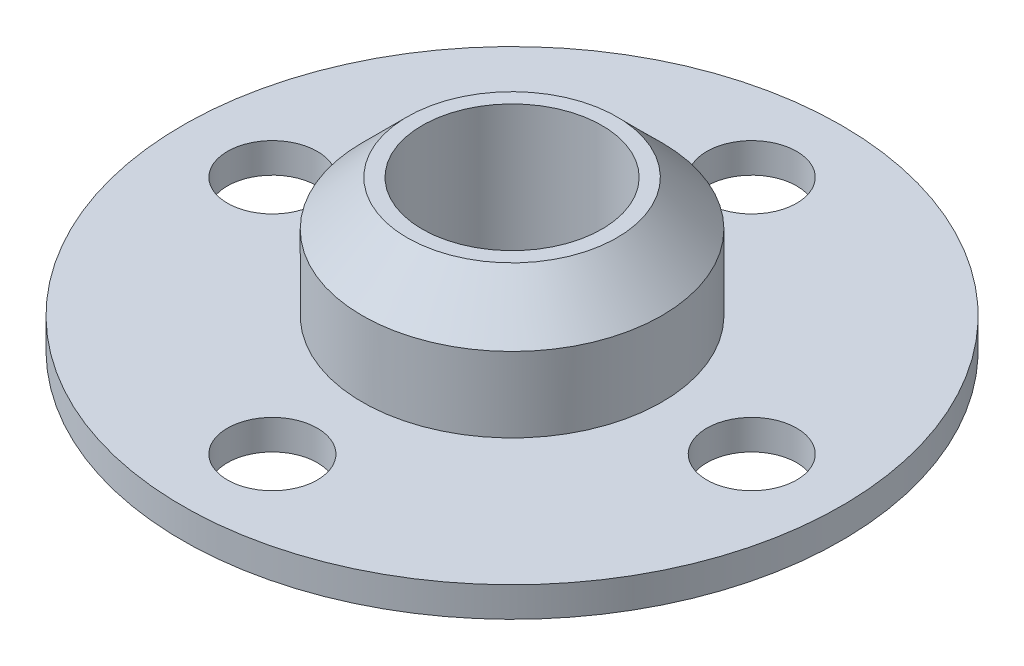
ISO-10303-21;
HEADER;
FILE_DESCRIPTION(('STEP AP214'),'2;1');
FILE_NAME('part.step','',(''),(''),'','','');
FILE_SCHEMA(('AUTOMOTIVE_DESIGN { 1 0 10303 214 1 1 1 1 }'));
ENDSEC;
DATA;
#1=APPLICATION_CONTEXT('core data for automotive mechanical design processes');
#2=APPLICATION_PROTOCOL_DEFINITION('international standard','automotive_design',2000,#1);
#3=PRODUCT_CONTEXT('',#1,'mechanical');
#4=PRODUCT('Part','Part','',(#3));
#5=PRODUCT_RELATED_PRODUCT_CATEGORY('part','',(#4));
#6=PRODUCT_DEFINITION_FORMATION('','',#4);
#7=PRODUCT_DEFINITION_CONTEXT('part definition',#1,'design');
#8=PRODUCT_DEFINITION('design','',#6,#7);
#9=PRODUCT_DEFINITION_SHAPE('','',#8);
#10=(LENGTH_UNIT() NAMED_UNIT(*) SI_UNIT(.MILLI.,.METRE.));
#11=(NAMED_UNIT(*) PLANE_ANGLE_UNIT() SI_UNIT($,.RADIAN.));
#12=(NAMED_UNIT(*) SI_UNIT($,.STERADIAN.) SOLID_ANGLE_UNIT());
#13=UNCERTAINTY_MEASURE_WITH_UNIT(LENGTH_MEASURE(1.E-05),#10,'distance_accuracy_value','');
#14=(GEOMETRIC_REPRESENTATION_CONTEXT(3) GLOBAL_UNCERTAINTY_ASSIGNED_CONTEXT((#13)) GLOBAL_UNIT_ASSIGNED_CONTEXT((#10,
#11,#12)) REPRESENTATION_CONTEXT('',''));
#15=CARTESIAN_POINT('',(0.,0.,0.));
#16=DIRECTION('',(0.,0.,1.));
#17=DIRECTION('',(1.,0.,0.));
#18=AXIS2_PLACEMENT_3D('',#15,#16,#17);
#19=CARTESIAN_POINT('',(0.,5.,0.));
#20=DIRECTION('',(0.,-1.,0.));
#21=DIRECTION('',(0.,0.,-1.));
#22=AXIS2_PLACEMENT_3D('',#19,#20,#21);
#23=CYLINDRICAL_SURFACE('',#22,5.);
#24=CARTESIAN_POINT('',(0.,3.5,0.));
#25=DIRECTION('',(0.,1.,0.));
#26=DIRECTION('',(0.,0.,1.));
#27=AXIS2_PLACEMENT_3D('',#24,#25,#26);
#28=CIRCLE('',#27,5.);
#29=CARTESIAN_POINT('',(0.,3.5,5.));
#30=VERTEX_POINT('',#29);
#31=EDGE_CURVE('E40',#30,#30,#28,.F.);
#32=ORIENTED_EDGE('',*,*,#31,.T.);
#33=EDGE_LOOP('',(#32));
#34=FACE_BOUND('',#33,.T.);
#35=CARTESIAN_POINT('',(0.,1.,0.));
#36=DIRECTION('',(0.,-1.,0.));
#37=DIRECTION('',(0.,0.,-1.));
#38=AXIS2_PLACEMENT_3D('',#35,#36,#37);
#39=CIRCLE('',#38,5.);
#40=CARTESIAN_POINT('',(0.,1.,-5.));
#41=VERTEX_POINT('',#40);
#42=EDGE_CURVE('E10',#41,#41,#39,.T.);
#43=ORIENTED_EDGE('',*,*,#42,.F.);
#44=EDGE_LOOP('',(#43));
#45=FACE_BOUND('',#44,.T.);
#46=ADVANCED_FACE('F35',(#34,#45),#23,.T.);
#47=CARTESIAN_POINT('',(0.,5.,0.));
#48=DIRECTION('',(0.,1.,0.));
#49=DIRECTION('',(0.,0.,1.));
#50=AXIS2_PLACEMENT_3D('',#47,#48,#49);
#51=PLANE('',#50);
#52=CARTESIAN_POINT('',(0.,5.,0.));
#53=DIRECTION('',(0.,1.,0.));
#54=DIRECTION('',(0.,0.,1.));
#55=AXIS2_PLACEMENT_3D('',#52,#53,#54);
#56=CIRCLE('',#55,3.5);
#57=CARTESIAN_POINT('',(0.,5.,3.5));
#58=VERTEX_POINT('',#57);
#59=EDGE_CURVE('E48',#58,#58,#56,.T.);
#60=ORIENTED_EDGE('',*,*,#59,.T.);
#61=EDGE_LOOP('',(#60));
#62=FACE_BOUND('',#61,.T.);
#63=CARTESIAN_POINT('',(0.,5.,0.));
#64=DIRECTION('',(0.,1.,0.));
#65=DIRECTION('',(0.,0.,1.));
#66=AXIS2_PLACEMENT_3D('',#63,#64,#65);
#67=CIRCLE('',#66,3.);
#68=CARTESIAN_POINT('',(0.,5.,3.));
#69=VERTEX_POINT('',#68);
#70=EDGE_CURVE('E53',#69,#69,#67,.T.);
#71=ORIENTED_EDGE('',*,*,#70,.F.);
#72=EDGE_LOOP('',(#71));
#73=FACE_BOUND('',#72,.T.);
#74=ADVANCED_FACE('F62',(#62,#73),#51,.T.);
#75=CARTESIAN_POINT('',(0.,0.,0.));
#76=DIRECTION('',(0.,1.,0.));
#77=DIRECTION('',(0.,0.,1.));
#78=AXIS2_PLACEMENT_3D('',#75,#76,#77);
#79=PLANE('',#78);
#80=CARTESIAN_POINT('',(0.,0.,0.));
#81=DIRECTION('',(0.,1.,0.));
#82=DIRECTION('',(0.,0.,1.));
#83=AXIS2_PLACEMENT_3D('',#80,#81,#82);
#84=CIRCLE('',#83,3.);
#85=CARTESIAN_POINT('',(0.,0.,3.));
#86=VERTEX_POINT('',#85);
#87=EDGE_CURVE('E56',#86,#86,#84,.T.);
#88=ORIENTED_EDGE('',*,*,#87,.T.);
#89=EDGE_LOOP('',(#88));
#90=FACE_BOUND('',#89,.T.);
#91=CARTESIAN_POINT('',(0.,0.,0.));
#92=DIRECTION('',(0.,-1.,0.));
#93=DIRECTION('',(0.,0.,-1.));
#94=AXIS2_PLACEMENT_3D('',#91,#92,#93);
#95=CIRCLE('',#94,11.);
#96=CARTESIAN_POINT('',(0.,0.,-11.));
#97=VERTEX_POINT('',#96);
#98=EDGE_CURVE('E51',#97,#97,#95,.T.);
#99=ORIENTED_EDGE('',*,*,#98,.T.);
#100=EDGE_LOOP('',(#99));
#101=FACE_BOUND('',#100,.T.);
#102=CARTESIAN_POINT('',(-8.,0.,0.));
#103=DIRECTION('',(0.,-1.,0.));
#104=DIRECTION('',(0.,0.,-1.));
#105=AXIS2_PLACEMENT_3D('',#102,#103,#104);
#106=CIRCLE('',#105,1.5);
#107=CARTESIAN_POINT('',(-8.,0.,-1.49999999999994));
#108=VERTEX_POINT('',#107);
#109=EDGE_CURVE('E118',#108,#108,#106,.T.);
#110=ORIENTED_EDGE('',*,*,#109,.F.);
#111=EDGE_LOOP('',(#110));
#112=FACE_BOUND('',#111,.T.);
#113=CARTESIAN_POINT('',(0.,0.,-8.));
#114=DIRECTION('',(0.,-1.,0.));
#115=DIRECTION('',(0.,0.,-1.));
#116=AXIS2_PLACEMENT_3D('',#113,#114,#115);
#117=CIRCLE('',#116,1.5);
#118=CARTESIAN_POINT('',(0.,0.,-9.5));
#119=VERTEX_POINT('',#118);
#120=EDGE_CURVE('E123',#119,#119,#117,.T.);
#121=ORIENTED_EDGE('',*,*,#120,.F.);
#122=EDGE_LOOP('',(#121));
#123=FACE_BOUND('',#122,.T.);
#124=CARTESIAN_POINT('',(0.,0.,8.));
#125=DIRECTION('',(0.,-1.,0.));
#126=DIRECTION('',(0.,0.,-1.));
#127=AXIS2_PLACEMENT_3D('',#124,#125,#126);
#128=CIRCLE('',#127,1.5);
#129=CARTESIAN_POINT('',(0.,0.,6.5));
#130=VERTEX_POINT('',#129);
#131=EDGE_CURVE('E127',#130,#130,#128,.T.);
#132=ORIENTED_EDGE('',*,*,#131,.F.);
#133=EDGE_LOOP('',(#132));
#134=FACE_BOUND('',#133,.T.);
#135=CARTESIAN_POINT('',(8.,0.,0.));
#136=DIRECTION('',(0.,-1.,0.));
#137=DIRECTION('',(0.,0.,-1.));
#138=AXIS2_PLACEMENT_3D('',#135,#136,#137);
#139=CIRCLE('',#138,1.5);
#140=CARTESIAN_POINT('',(8.,0.,-1.5));
#141=VERTEX_POINT('',#140);
#142=EDGE_CURVE('E132',#141,#141,#139,.T.);
#143=ORIENTED_EDGE('',*,*,#142,.F.);
#144=EDGE_LOOP('',(#143));
#145=FACE_BOUND('',#144,.T.);
#146=ADVANCED_FACE('F76',(#90,#101,#112,#123,#134,#145),#79,.F.);
#147=CARTESIAN_POINT('',(0.,5.,0.));
#148=DIRECTION('',(0.,-1.,0.));
#149=DIRECTION('',(0.,0.,-1.));
#150=AXIS2_PLACEMENT_3D('',#147,#148,#149);
#151=CYLINDRICAL_SURFACE('',#150,3.);
#152=ORIENTED_EDGE('',*,*,#87,.F.);
#153=EDGE_LOOP('',(#152));
#154=FACE_BOUND('',#153,.T.);
#155=ORIENTED_EDGE('',*,*,#70,.T.);
#156=EDGE_LOOP('',(#155));
#157=FACE_BOUND('',#156,.T.);
#158=ADVANCED_FACE('F67',(#154,#157),#151,.F.);
#159=CARTESIAN_POINT('',(0.,5.,0.));
#160=DIRECTION('',(0.,-1.,0.));
#161=DIRECTION('',(0.,0.,-1.));
#162=AXIS2_PLACEMENT_3D('',#159,#160,#161);
#163=CONICAL_SURFACE('',#162,3.5,0.785398163397446);
#164=ORIENTED_EDGE('',*,*,#31,.F.);
#165=EDGE_LOOP('',(#164));
#166=FACE_BOUND('',#165,.T.);
#167=ORIENTED_EDGE('',*,*,#59,.F.);
#168=EDGE_LOOP('',(#167));
#169=FACE_BOUND('',#168,.T.);
#170=ADVANCED_FACE('F38',(#166,#169),#163,.T.);
#171=CARTESIAN_POINT('',(0.,1.,0.));
#172=DIRECTION('',(0.,-1.,0.));
#173=DIRECTION('',(0.,0.,-1.));
#174=AXIS2_PLACEMENT_3D('',#171,#172,#173);
#175=PLANE('',#174);
#176=CARTESIAN_POINT('',(0.,1.,0.));
#177=DIRECTION('',(0.,-1.,0.));
#178=DIRECTION('',(0.,0.,-1.));
#179=AXIS2_PLACEMENT_3D('',#176,#177,#178);
#180=CIRCLE('',#179,11.);
#181=CARTESIAN_POINT('',(0.,1.,-11.));
#182=VERTEX_POINT('',#181);
#183=EDGE_CURVE('E58',#182,#182,#180,.T.);
#184=ORIENTED_EDGE('',*,*,#183,.F.);
#185=EDGE_LOOP('',(#184));
#186=FACE_BOUND('',#185,.T.);
#187=CARTESIAN_POINT('',(-8.,1.,0.));
#188=DIRECTION('',(0.,-1.,0.));
#189=DIRECTION('',(0.,0.,-1.));
#190=AXIS2_PLACEMENT_3D('',#187,#188,#189);
#191=CIRCLE('',#190,1.5);
#192=CARTESIAN_POINT('',(-8.,1.,-1.49999999999994));
#193=VERTEX_POINT('',#192);
#194=EDGE_CURVE('E136',#193,#193,#191,.T.);
#195=ORIENTED_EDGE('',*,*,#194,.T.);
#196=EDGE_LOOP('',(#195));
#197=FACE_BOUND('',#196,.T.);
#198=CARTESIAN_POINT('',(0.,1.,-8.));
#199=DIRECTION('',(0.,-1.,0.));
#200=DIRECTION('',(0.,0.,-1.));
#201=AXIS2_PLACEMENT_3D('',#198,#199,#200);
#202=CIRCLE('',#201,1.5);
#203=CARTESIAN_POINT('',(0.,1.,-9.5));
#204=VERTEX_POINT('',#203);
#205=EDGE_CURVE('E139',#204,#204,#202,.T.);
#206=ORIENTED_EDGE('',*,*,#205,.T.);
#207=EDGE_LOOP('',(#206));
#208=FACE_BOUND('',#207,.T.);
#209=CARTESIAN_POINT('',(0.,1.,8.));
#210=DIRECTION('',(0.,-1.,0.));
#211=DIRECTION('',(0.,0.,-1.));
#212=AXIS2_PLACEMENT_3D('',#209,#210,#211);
#213=CIRCLE('',#212,1.5);
#214=CARTESIAN_POINT('',(0.,1.,6.5));
#215=VERTEX_POINT('',#214);
#216=EDGE_CURVE('E120',#215,#215,#213,.T.);
#217=ORIENTED_EDGE('',*,*,#216,.T.);
#218=EDGE_LOOP('',(#217));
#219=FACE_BOUND('',#218,.T.);
#220=CARTESIAN_POINT('',(8.,1.,0.));
#221=DIRECTION('',(0.,-1.,0.));
#222=DIRECTION('',(0.,0.,-1.));
#223=AXIS2_PLACEMENT_3D('',#220,#221,#222);
#224=CIRCLE('',#223,1.5);
#225=CARTESIAN_POINT('',(8.,1.,-1.5));
#226=VERTEX_POINT('',#225);
#227=EDGE_CURVE('E117',#226,#226,#224,.T.);
#228=ORIENTED_EDGE('',*,*,#227,.T.);
#229=EDGE_LOOP('',(#228));
#230=FACE_BOUND('',#229,.T.);
#231=ORIENTED_EDGE('',*,*,#42,.T.);
#232=EDGE_LOOP('',(#231));
#233=FACE_BOUND('',#232,.T.);
#234=ADVANCED_FACE('F66',(#186,#197,#208,#219,#230,#233),#175,.F.);
#235=CARTESIAN_POINT('',(-8.,1.,0.));
#236=DIRECTION('',(0.,-1.,0.));
#237=DIRECTION('',(0.,0.,-1.));
#238=AXIS2_PLACEMENT_3D('',#235,#236,#237);
#239=CYLINDRICAL_SURFACE('',#238,1.5);
#240=ORIENTED_EDGE('',*,*,#194,.F.);
#241=EDGE_LOOP('',(#240));
#242=FACE_BOUND('',#241,.T.);
#243=ORIENTED_EDGE('',*,*,#109,.T.);
#244=EDGE_LOOP('',(#243));
#245=FACE_BOUND('',#244,.T.);
#246=ADVANCED_FACE('F73',(#242,#245),#239,.F.);
#247=CARTESIAN_POINT('',(0.,1.,-8.));
#248=DIRECTION('',(0.,-1.,0.));
#249=DIRECTION('',(0.,0.,-1.));
#250=AXIS2_PLACEMENT_3D('',#247,#248,#249);
#251=CYLINDRICAL_SURFACE('',#250,1.5);
#252=ORIENTED_EDGE('',*,*,#205,.F.);
#253=EDGE_LOOP('',(#252));
#254=FACE_BOUND('',#253,.T.);
#255=ORIENTED_EDGE('',*,*,#120,.T.);
#256=EDGE_LOOP('',(#255));
#257=FACE_BOUND('',#256,.T.);
#258=ADVANCED_FACE('F99',(#254,#257),#251,.F.);
#259=CARTESIAN_POINT('',(0.,1.,8.));
#260=DIRECTION('',(0.,-1.,0.));
#261=DIRECTION('',(0.,0.,-1.));
#262=AXIS2_PLACEMENT_3D('',#259,#260,#261);
#263=CYLINDRICAL_SURFACE('',#262,1.5);
#264=ORIENTED_EDGE('',*,*,#216,.F.);
#265=EDGE_LOOP('',(#264));
#266=FACE_BOUND('',#265,.T.);
#267=ORIENTED_EDGE('',*,*,#131,.T.);
#268=EDGE_LOOP('',(#267));
#269=FACE_BOUND('',#268,.T.);
#270=ADVANCED_FACE('F95',(#266,#269),#263,.F.);
#271=CARTESIAN_POINT('',(8.,1.,0.));
#272=DIRECTION('',(0.,-1.,0.));
#273=DIRECTION('',(0.,0.,-1.));
#274=AXIS2_PLACEMENT_3D('',#271,#272,#273);
#275=CYLINDRICAL_SURFACE('',#274,1.5);
#276=ORIENTED_EDGE('',*,*,#227,.F.);
#277=EDGE_LOOP('',(#276));
#278=FACE_BOUND('',#277,.T.);
#279=ORIENTED_EDGE('',*,*,#142,.T.);
#280=EDGE_LOOP('',(#279));
#281=FACE_BOUND('',#280,.T.);
#282=ADVANCED_FACE('F91',(#278,#281),#275,.F.);
#283=CARTESIAN_POINT('',(0.,1.,0.));
#284=DIRECTION('',(0.,-1.,0.));
#285=DIRECTION('',(0.,0.,-1.));
#286=AXIS2_PLACEMENT_3D('',#283,#284,#285);
#287=CYLINDRICAL_SURFACE('',#286,11.);
#288=ORIENTED_EDGE('',*,*,#183,.T.);
#289=EDGE_LOOP('',(#288));
#290=FACE_BOUND('',#289,.T.);
#291=ORIENTED_EDGE('',*,*,#98,.F.);
#292=EDGE_LOOP('',(#291));
#293=FACE_BOUND('',#292,.T.);
#294=ADVANCED_FACE('F94',(#290,#293),#287,.T.);
#295=CLOSED_SHELL('',(#46,#74,#146,#158,#170,#234,#246,#258,#270,#282,#294));
#296=MANIFOLD_SOLID_BREP('B2',#295);
#297=ADVANCED_BREP_SHAPE_REPRESENTATION('',(#18,#296),#14);
#298=SHAPE_DEFINITION_REPRESENTATION(#9,#297);
ENDSEC;
END-ISO-10303-21;
